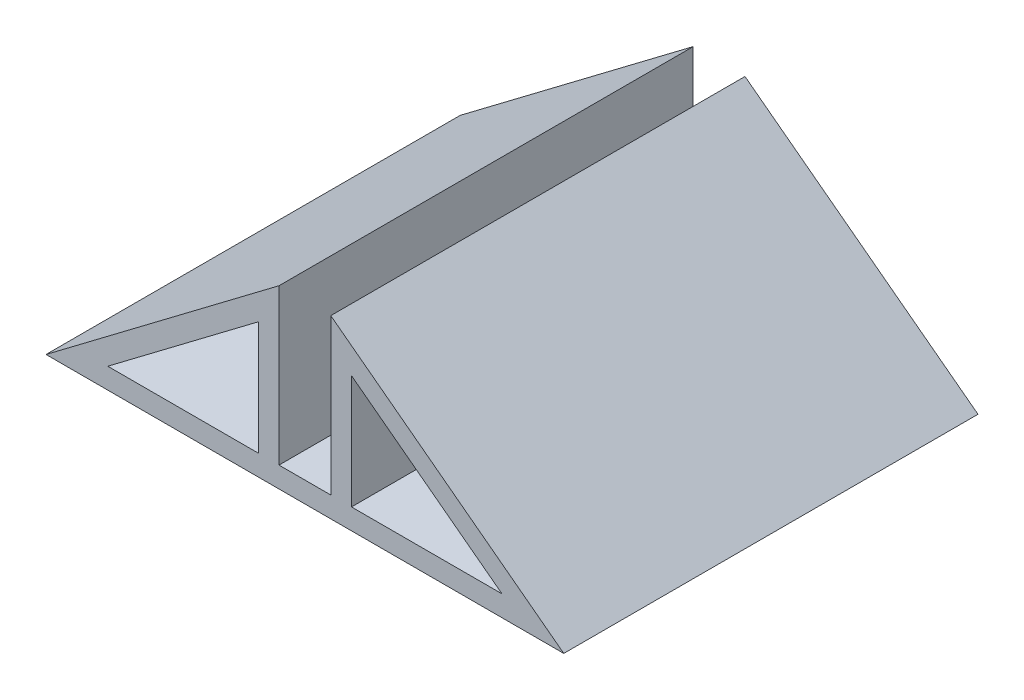
ISO-10303-21;
HEADER;
FILE_DESCRIPTION(('STEP AP214'),'2;1');
FILE_NAME('part.step','',(''),(''),'','','');
FILE_SCHEMA(('AUTOMOTIVE_DESIGN { 1 0 10303 214 1 1 1 1 }'));
ENDSEC;
DATA;
#1=APPLICATION_CONTEXT('core data for automotive mechanical design processes');
#2=APPLICATION_PROTOCOL_DEFINITION('international standard','automotive_design',2000,#1);
#3=PRODUCT_CONTEXT('',#1,'mechanical');
#4=PRODUCT('Part','Part','',(#3));
#5=PRODUCT_RELATED_PRODUCT_CATEGORY('part','',(#4));
#6=PRODUCT_DEFINITION_FORMATION('','',#4);
#7=PRODUCT_DEFINITION_CONTEXT('part definition',#1,'design');
#8=PRODUCT_DEFINITION('design','',#6,#7);
#9=PRODUCT_DEFINITION_SHAPE('','',#8);
#10=(LENGTH_UNIT() NAMED_UNIT(*) SI_UNIT(.MILLI.,.METRE.));
#11=(NAMED_UNIT(*) PLANE_ANGLE_UNIT() SI_UNIT($,.RADIAN.));
#12=(NAMED_UNIT(*) SI_UNIT($,.STERADIAN.) SOLID_ANGLE_UNIT());
#13=UNCERTAINTY_MEASURE_WITH_UNIT(LENGTH_MEASURE(1.E-05),#10,'distance_accuracy_value','');
#14=(GEOMETRIC_REPRESENTATION_CONTEXT(3) GLOBAL_UNCERTAINTY_ASSIGNED_CONTEXT((#13)) GLOBAL_UNIT_ASSIGNED_CONTEXT((#10,
#11,#12)) REPRESENTATION_CONTEXT('',''));
#15=CARTESIAN_POINT('',(0.,0.,0.));
#16=DIRECTION('',(0.,0.,1.));
#17=DIRECTION('',(1.,0.,0.));
#18=AXIS2_PLACEMENT_3D('',#15,#16,#17);
#19=CARTESIAN_POINT('',(-41.503196968335,54.9307018698557,40.));
#20=DIRECTION('',(-0.602833089185688,0.797867323922242,0.));
#21=DIRECTION('',(-0.797867323922242,-0.602833089185688,0.));
#22=AXIS2_PLACEMENT_3D('',#19,#20,#21);
#23=PLANE('',#22);
#24=DIRECTION('',(0.797867323922242,0.602833089185688,0.));
#25=VECTOR('',#24,1.);
#26=CARTESIAN_POINT('',(-41.503196968335,54.9307018698557,0.));
#27=LINE('',#26,#25);
#28=CARTESIAN_POINT('',(-176.322162687231,-46.9325166733095,0.));
#29=VERTEX_POINT('',#28);
#30=CARTESIAN_POINT('',(-161.786889428927,-35.9503102114793,0.));
#31=VERTEX_POINT('',#30);
#32=EDGE_CURVE('E142',#29,#31,#27,.T.);
#33=ORIENTED_EDGE('',*,*,#32,.T.);
#34=DIRECTION('',(0.,0.,-1.));
#35=VECTOR('',#34,1.);
#36=CARTESIAN_POINT('',(-161.786889428927,-35.9503102114793,40.));
#37=LINE('',#36,#35);
#38=CARTESIAN_POINT('',(-161.786889428927,-35.9503102114793,40.));
#39=VERTEX_POINT('',#38);
#40=EDGE_CURVE('E11',#39,#31,#37,.T.);
#41=ORIENTED_EDGE('',*,*,#40,.F.);
#42=DIRECTION('',(0.797867323922242,0.602833089185688,0.));
#43=VECTOR('',#42,1.);
#44=CARTESIAN_POINT('',(-41.503196968335,54.9307018698557,40.));
#45=LINE('',#44,#43);
#46=CARTESIAN_POINT('',(-176.322162687231,-46.9325166733095,40.));
#47=VERTEX_POINT('',#46);
#48=EDGE_CURVE('E134',#47,#39,#45,.T.);
#49=ORIENTED_EDGE('',*,*,#48,.F.);
#50=DIRECTION('',(0.,0.,-1.));
#51=VECTOR('',#50,1.);
#52=CARTESIAN_POINT('',(-176.322162687231,-46.9325166733095,40.));
#53=LINE('',#52,#51);
#54=EDGE_CURVE('E143',#47,#29,#53,.T.);
#55=ORIENTED_EDGE('',*,*,#54,.T.);
#56=EDGE_LOOP('',(#33,#41,#49,#55));
#57=FACE_BOUND('',#56,.T.);
#58=ADVANCED_FACE('F33',(#57),#23,.F.);
#59=CARTESIAN_POINT('',(-161.786889428927,0.,40.));
#60=DIRECTION('',(1.,0.,0.));
#61=DIRECTION('',(0.,0.,-1.));
#62=AXIS2_PLACEMENT_3D('',#59,#60,#61);
#63=PLANE('',#62);
#64=DIRECTION('',(0.,-1.,0.));
#65=VECTOR('',#64,1.);
#66=CARTESIAN_POINT('',(-161.786889428927,0.,0.));
#67=LINE('',#66,#65);
#68=CARTESIAN_POINT('',(-161.786889428927,-46.9325166733095,0.));
#69=VERTEX_POINT('',#68);
#70=EDGE_CURVE('E91',#31,#69,#67,.T.);
#71=ORIENTED_EDGE('',*,*,#70,.T.);
#72=DIRECTION('',(0.,0.,-1.));
#73=VECTOR('',#72,1.);
#74=CARTESIAN_POINT('',(-161.786889428927,-46.9325166733095,40.));
#75=LINE('',#74,#73);
#76=CARTESIAN_POINT('',(-161.786889428927,-46.9325166733095,40.));
#77=VERTEX_POINT('',#76);
#78=EDGE_CURVE('E43',#77,#69,#75,.T.);
#79=ORIENTED_EDGE('',*,*,#78,.F.);
#80=DIRECTION('',(0.,-1.,0.));
#81=VECTOR('',#80,1.);
#82=CARTESIAN_POINT('',(-161.786889428927,0.,40.));
#83=LINE('',#82,#81);
#84=EDGE_CURVE('E130',#39,#77,#83,.T.);
#85=ORIENTED_EDGE('',*,*,#84,.F.);
#86=ORIENTED_EDGE('',*,*,#40,.T.);
#87=EDGE_LOOP('',(#71,#79,#85,#86));
#88=FACE_BOUND('',#87,.T.);
#89=ADVANCED_FACE('F131',(#88),#63,.F.);
#90=CARTESIAN_POINT('',(-71.609680820497,-94.7775187330115,40.));
#91=DIRECTION('',(-0.602833089185689,-0.797867323922242,0.));
#92=DIRECTION('',(0.797867323922242,-0.602833089185689,0.));
#93=AXIS2_PLACEMENT_3D('',#90,#91,#92);
#94=PLANE('',#93);
#95=DIRECTION('',(-0.797867323922242,0.602833089185689,0.));
#96=VECTOR('',#95,1.);
#97=CARTESIAN_POINT('',(-71.609680820497,-94.7775187330115,0.));
#98=LINE('',#97,#96);
#99=CARTESIAN_POINT('',(-132.286889428927,-48.9325166733095,0.));
#100=VERTEX_POINT('',#99);
#101=CARTESIAN_POINT('',(-154.786889428927,-31.9325166733097,0.));
#102=VERTEX_POINT('',#101);
#103=EDGE_CURVE('E193',#100,#102,#98,.T.);
#104=ORIENTED_EDGE('',*,*,#103,.T.);
#105=DIRECTION('',(0.,0.,-1.));
#106=VECTOR('',#105,1.);
#107=CARTESIAN_POINT('',(-154.786889428927,-31.9325166733097,40.));
#108=LINE('',#107,#106);
#109=CARTESIAN_POINT('',(-154.786889428927,-31.9325166733097,40.));
#110=VERTEX_POINT('',#109);
#111=EDGE_CURVE('E156',#110,#102,#108,.T.);
#112=ORIENTED_EDGE('',*,*,#111,.F.);
#113=DIRECTION('',(-0.797867323922242,0.602833089185689,0.));
#114=VECTOR('',#113,1.);
#115=CARTESIAN_POINT('',(-71.609680820497,-94.7775187330115,40.));
#116=LINE('',#115,#114);
#117=CARTESIAN_POINT('',(-132.286889428927,-48.9325166733095,40.));
#118=VERTEX_POINT('',#117);
#119=EDGE_CURVE('E235',#118,#110,#116,.T.);
#120=ORIENTED_EDGE('',*,*,#119,.F.);
#121=DIRECTION('',(0.,0.,-1.));
#122=VECTOR('',#121,1.);
#123=CARTESIAN_POINT('',(-132.286889428927,-48.9325166733095,40.));
#124=LINE('',#123,#122);
#125=EDGE_CURVE('E158',#118,#100,#124,.T.);
#126=ORIENTED_EDGE('',*,*,#125,.T.);
#127=EDGE_LOOP('',(#104,#112,#120,#126));
#128=FACE_BOUND('',#127,.T.);
#129=ADVANCED_FACE('F234',(#128),#94,.F.);
#130=CARTESIAN_POINT('',(-154.786889428927,0.,40.));
#131=DIRECTION('',(1.,0.,0.));
#132=DIRECTION('',(0.,0.,-1.));
#133=AXIS2_PLACEMENT_3D('',#130,#131,#132);
#134=PLANE('',#133);
#135=DIRECTION('',(0.,-1.,0.));
#136=VECTOR('',#135,1.);
#137=CARTESIAN_POINT('',(-154.786889428927,0.,0.));
#138=LINE('',#137,#136);
#139=CARTESIAN_POINT('',(-154.786889428927,-46.9325166733095,0.));
#140=VERTEX_POINT('',#139);
#141=EDGE_CURVE('E199',#102,#140,#138,.T.);
#142=ORIENTED_EDGE('',*,*,#141,.T.);
#143=DIRECTION('',(0.,0.,-1.));
#144=VECTOR('',#143,1.);
#145=CARTESIAN_POINT('',(-154.786889428927,-46.9325166733095,40.));
#146=LINE('',#145,#144);
#147=CARTESIAN_POINT('',(-154.786889428927,-46.9325166733095,40.));
#148=VERTEX_POINT('',#147);
#149=EDGE_CURVE('E166',#148,#140,#146,.T.);
#150=ORIENTED_EDGE('',*,*,#149,.F.);
#151=DIRECTION('',(0.,-1.,0.));
#152=VECTOR('',#151,1.);
#153=CARTESIAN_POINT('',(-154.786889428927,0.,40.));
#154=LINE('',#153,#152);
#155=EDGE_CURVE('E230',#110,#148,#154,.T.);
#156=ORIENTED_EDGE('',*,*,#155,.F.);
#157=ORIENTED_EDGE('',*,*,#111,.T.);
#158=EDGE_LOOP('',(#142,#150,#156,#157));
#159=FACE_BOUND('',#158,.T.);
#160=ADVANCED_FACE('F229',(#159),#134,.F.);
#161=CARTESIAN_POINT('',(0.,-46.9325166733095,40.));
#162=DIRECTION('',(0.,-1.,0.));
#163=DIRECTION('',(0.,0.,-1.));
#164=AXIS2_PLACEMENT_3D('',#161,#162,#163);
#165=PLANE('',#164);
#166=DIRECTION('',(-1.,0.,0.));
#167=VECTOR('',#166,1.);
#168=CARTESIAN_POINT('',(0.,-46.9325166733095,0.));
#169=LINE('',#168,#167);
#170=CARTESIAN_POINT('',(-159.786889428927,-46.9325166733095,0.));
#171=VERTEX_POINT('',#170);
#172=EDGE_CURVE('E201',#140,#171,#169,.T.);
#173=ORIENTED_EDGE('',*,*,#172,.T.);
#174=DIRECTION('',(0.,0.,-1.));
#175=VECTOR('',#174,1.);
#176=CARTESIAN_POINT('',(-159.786889428927,-46.9325166733095,40.));
#177=LINE('',#176,#175);
#178=CARTESIAN_POINT('',(-159.786889428927,-46.9325166733095,40.));
#179=VERTEX_POINT('',#178);
#180=EDGE_CURVE('E164',#179,#171,#177,.T.);
#181=ORIENTED_EDGE('',*,*,#180,.F.);
#182=DIRECTION('',(-1.,0.,0.));
#183=VECTOR('',#182,1.);
#184=CARTESIAN_POINT('',(0.,-46.9325166733095,40.));
#185=LINE('',#184,#183);
#186=EDGE_CURVE('E245',#148,#179,#185,.T.);
#187=ORIENTED_EDGE('',*,*,#186,.F.);
#188=ORIENTED_EDGE('',*,*,#149,.T.);
#189=EDGE_LOOP('',(#173,#181,#187,#188));
#190=FACE_BOUND('',#189,.T.);
#191=ADVANCED_FACE('F225',(#190),#165,.F.);
#192=CARTESIAN_POINT('',(-159.786889428927,0.,40.));
#193=DIRECTION('',(1.,0.,0.));
#194=DIRECTION('',(0.,0.,-1.));
#195=AXIS2_PLACEMENT_3D('',#192,#193,#194);
#196=PLANE('',#195);
#197=DIRECTION('',(0.,-1.,0.));
#198=VECTOR('',#197,1.);
#199=CARTESIAN_POINT('',(-159.786889428927,0.,0.));
#200=LINE('',#199,#198);
#201=CARTESIAN_POINT('',(-159.786889428927,-31.9325166733097,0.));
#202=VERTEX_POINT('',#201);
#203=EDGE_CURVE('E204',#202,#171,#200,.T.);
#204=ORIENTED_EDGE('',*,*,#203,.F.);
#205=DIRECTION('',(0.,0.,-1.));
#206=VECTOR('',#205,1.);
#207=CARTESIAN_POINT('',(-159.786889428927,-31.9325166733097,40.));
#208=LINE('',#207,#206);
#209=CARTESIAN_POINT('',(-159.786889428927,-31.9325166733097,40.));
#210=VERTEX_POINT('',#209);
#211=EDGE_CURVE('E162',#210,#202,#208,.T.);
#212=ORIENTED_EDGE('',*,*,#211,.F.);
#213=DIRECTION('',(0.,-1.,0.));
#214=VECTOR('',#213,1.);
#215=CARTESIAN_POINT('',(-159.786889428927,0.,40.));
#216=LINE('',#215,#214);
#217=EDGE_CURVE('E222',#210,#179,#216,.T.);
#218=ORIENTED_EDGE('',*,*,#217,.T.);
#219=ORIENTED_EDGE('',*,*,#180,.T.);
#220=EDGE_LOOP('',(#204,#212,#218,#219));
#221=FACE_BOUND('',#220,.T.);
#222=ADVANCED_FACE('F220',(#221),#196,.T.);
#223=CARTESIAN_POINT('',(-42.7088631467065,56.5264365177003,40.));
#224=DIRECTION('',(-0.602833089185689,0.797867323922242,0.));
#225=DIRECTION('',(-0.797867323922242,-0.602833089185689,0.));
#226=AXIS2_PLACEMENT_3D('',#223,#224,#225);
#227=PLANE('',#226);
#228=DIRECTION('',(0.797867323922242,0.602833089185689,0.));
#229=VECTOR('',#228,1.);
#230=CARTESIAN_POINT('',(-42.7088631467065,56.5264365177003,0.));
#231=LINE('',#230,#229);
#232=CARTESIAN_POINT('',(-182.286889428927,-48.9325166733095,0.));
#233=VERTEX_POINT('',#232);
#234=EDGE_CURVE('E149',#233,#202,#231,.T.);
#235=ORIENTED_EDGE('',*,*,#234,.F.);
#236=DIRECTION('',(0.,0.,-1.));
#237=VECTOR('',#236,1.);
#238=CARTESIAN_POINT('',(-182.286889428927,-48.9325166733095,40.));
#239=LINE('',#238,#237);
#240=CARTESIAN_POINT('',(-182.286889428927,-48.9325166733095,40.));
#241=VERTEX_POINT('',#240);
#242=EDGE_CURVE('E160',#241,#233,#239,.T.);
#243=ORIENTED_EDGE('',*,*,#242,.F.);
#244=DIRECTION('',(0.797867323922242,0.602833089185689,0.));
#245=VECTOR('',#244,1.);
#246=CARTESIAN_POINT('',(-42.7088631467065,56.5264365177003,40.));
#247=LINE('',#246,#245);
#248=EDGE_CURVE('E216',#241,#210,#247,.T.);
#249=ORIENTED_EDGE('',*,*,#248,.T.);
#250=ORIENTED_EDGE('',*,*,#211,.T.);
#251=EDGE_LOOP('',(#235,#243,#249,#250));
#252=FACE_BOUND('',#251,.T.);
#253=ADVANCED_FACE('F213',(#252),#227,.T.);
#254=CARTESIAN_POINT('',(-72.8153469988683,-96.3732533808561,40.));
#255=DIRECTION('',(-0.602833089185688,-0.797867323922242,0.));
#256=DIRECTION('',(0.797867323922242,-0.602833089185688,0.));
#257=AXIS2_PLACEMENT_3D('',#254,#255,#256);
#258=PLANE('',#257);
#259=DIRECTION('',(-0.797867323922242,0.602833089185688,0.));
#260=VECTOR('',#259,1.);
#261=CARTESIAN_POINT('',(-72.8153469988683,-96.3732533808561,0.));
#262=LINE('',#261,#260);
#263=CARTESIAN_POINT('',(-138.251616170622,-46.9325166733095,0.));
#264=VERTEX_POINT('',#263);
#265=CARTESIAN_POINT('',(-152.786889428927,-35.9503102114793,0.));
#266=VERTEX_POINT('',#265);
#267=EDGE_CURVE('E186',#264,#266,#262,.T.);
#268=ORIENTED_EDGE('',*,*,#267,.F.);
#269=DIRECTION('',(0.,0.,-1.));
#270=VECTOR('',#269,1.);
#271=CARTESIAN_POINT('',(-138.251616170622,-46.9325166733095,40.));
#272=LINE('',#271,#270);
#273=CARTESIAN_POINT('',(-138.251616170622,-46.9325166733095,40.));
#274=VERTEX_POINT('',#273);
#275=EDGE_CURVE('E37',#274,#264,#272,.T.);
#276=ORIENTED_EDGE('',*,*,#275,.F.);
#277=DIRECTION('',(-0.797867323922242,0.602833089185688,0.));
#278=VECTOR('',#277,1.);
#279=CARTESIAN_POINT('',(-72.8153469988683,-96.3732533808561,40.));
#280=LINE('',#279,#278);
#281=CARTESIAN_POINT('',(-152.786889428927,-35.9503102114793,40.));
#282=VERTEX_POINT('',#281);
#283=EDGE_CURVE('E154',#274,#282,#280,.T.);
#284=ORIENTED_EDGE('',*,*,#283,.T.);
#285=DIRECTION('',(0.,0.,-1.));
#286=VECTOR('',#285,1.);
#287=CARTESIAN_POINT('',(-152.786889428927,-35.9503102114793,40.));
#288=LINE('',#287,#286);
#289=EDGE_CURVE('E171',#282,#266,#288,.T.);
#290=ORIENTED_EDGE('',*,*,#289,.T.);
#291=EDGE_LOOP('',(#268,#276,#284,#290));
#292=FACE_BOUND('',#291,.T.);
#293=ADVANCED_FACE('F35',(#292),#258,.T.);
#294=CARTESIAN_POINT('',(0.,-46.9325166733095,40.));
#295=DIRECTION('',(0.,1.,0.));
#296=DIRECTION('',(-1.,0.,0.));
#297=AXIS2_PLACEMENT_3D('',#294,#295,#296);
#298=PLANE('',#297);
#299=DIRECTION('',(1.,0.,0.));
#300=VECTOR('',#299,1.);
#301=CARTESIAN_POINT('',(0.,-46.9325166733095,0.));
#302=LINE('',#301,#300);
#303=CARTESIAN_POINT('',(-152.786889428927,-46.9325166733095,0.));
#304=VERTEX_POINT('',#303);
#305=EDGE_CURVE('E181',#304,#264,#302,.T.);
#306=ORIENTED_EDGE('',*,*,#305,.F.);
#307=DIRECTION('',(0.,0.,-1.));
#308=VECTOR('',#307,1.);
#309=CARTESIAN_POINT('',(-152.786889428927,-46.9325166733095,40.));
#310=LINE('',#309,#308);
#311=CARTESIAN_POINT('',(-152.786889428927,-46.9325166733095,40.));
#312=VERTEX_POINT('',#311);
#313=EDGE_CURVE('E172',#312,#304,#310,.T.);
#314=ORIENTED_EDGE('',*,*,#313,.F.);
#315=DIRECTION('',(1.,0.,0.));
#316=VECTOR('',#315,1.);
#317=CARTESIAN_POINT('',(0.,-46.9325166733095,40.));
#318=LINE('',#317,#316);
#319=EDGE_CURVE('E184',#312,#274,#318,.T.);
#320=ORIENTED_EDGE('',*,*,#319,.T.);
#321=ORIENTED_EDGE('',*,*,#275,.T.);
#322=EDGE_LOOP('',(#306,#314,#320,#321));
#323=FACE_BOUND('',#322,.T.);
#324=ADVANCED_FACE('F179',(#323),#298,.T.);
#325=CARTESIAN_POINT('',(0.,-48.9325166733095,40.));
#326=DIRECTION('',(0.,-1.,0.));
#327=DIRECTION('',(0.,0.,-1.));
#328=AXIS2_PLACEMENT_3D('',#325,#326,#327);
#329=PLANE('',#328);
#330=DIRECTION('',(-1.,0.,0.));
#331=VECTOR('',#330,1.);
#332=CARTESIAN_POINT('',(0.,-48.9325166733095,0.));
#333=LINE('',#332,#331);
#334=EDGE_CURVE('E145',#100,#233,#333,.T.);
#335=ORIENTED_EDGE('',*,*,#334,.F.);
#336=ORIENTED_EDGE('',*,*,#125,.F.);
#337=DIRECTION('',(-1.,0.,0.));
#338=VECTOR('',#337,1.);
#339=CARTESIAN_POINT('',(0.,-48.9325166733095,40.));
#340=LINE('',#339,#338);
#341=EDGE_CURVE('E139',#118,#241,#340,.T.);
#342=ORIENTED_EDGE('',*,*,#341,.T.);
#343=ORIENTED_EDGE('',*,*,#242,.T.);
#344=EDGE_LOOP('',(#335,#336,#342,#343));
#345=FACE_BOUND('',#344,.T.);
#346=ADVANCED_FACE('F239',(#345),#329,.T.);
#347=CARTESIAN_POINT('',(-152.786889428927,0.,40.));
#348=DIRECTION('',(1.,0.,0.));
#349=DIRECTION('',(0.,0.,-1.));
#350=AXIS2_PLACEMENT_3D('',#347,#348,#349);
#351=PLANE('',#350);
#352=DIRECTION('',(0.,-1.,0.));
#353=VECTOR('',#352,1.);
#354=CARTESIAN_POINT('',(-152.786889428927,0.,0.));
#355=LINE('',#354,#353);
#356=EDGE_CURVE('E191',#266,#304,#355,.T.);
#357=ORIENTED_EDGE('',*,*,#356,.F.);
#358=ORIENTED_EDGE('',*,*,#289,.F.);
#359=DIRECTION('',(0.,-1.,0.));
#360=VECTOR('',#359,1.);
#361=CARTESIAN_POINT('',(-152.786889428927,0.,40.));
#362=LINE('',#361,#360);
#363=EDGE_CURVE('E249',#282,#312,#362,.T.);
#364=ORIENTED_EDGE('',*,*,#363,.T.);
#365=ORIENTED_EDGE('',*,*,#313,.T.);
#366=EDGE_LOOP('',(#357,#358,#364,#365));
#367=FACE_BOUND('',#366,.T.);
#368=ADVANCED_FACE('F254',(#367),#351,.T.);
#369=CARTESIAN_POINT('',(0.,-46.9325166733096,40.));
#370=DIRECTION('',(0.,-1.,0.));
#371=DIRECTION('',(1.,0.,0.));
#372=AXIS2_PLACEMENT_3D('',#369,#370,#371);
#373=PLANE('',#372);
#374=DIRECTION('',(-1.,0.,0.));
#375=VECTOR('',#374,1.);
#376=CARTESIAN_POINT('',(0.,-46.9325166733096,0.));
#377=LINE('',#376,#375);
#378=EDGE_CURVE('E97',#69,#29,#377,.T.);
#379=ORIENTED_EDGE('',*,*,#378,.T.);
#380=ORIENTED_EDGE('',*,*,#54,.F.);
#381=DIRECTION('',(-1.,0.,0.));
#382=VECTOR('',#381,1.);
#383=CARTESIAN_POINT('',(0.,-46.9325166733096,40.));
#384=LINE('',#383,#382);
#385=EDGE_CURVE('E52',#77,#47,#384,.T.);
#386=ORIENTED_EDGE('',*,*,#385,.F.);
#387=ORIENTED_EDGE('',*,*,#78,.T.);
#388=EDGE_LOOP('',(#379,#380,#386,#387));
#389=FACE_BOUND('',#388,.T.);
#390=ADVANCED_FACE('F256',(#389),#373,.F.);
#391=CARTESIAN_POINT('',(0.,0.,40.));
#392=DIRECTION('',(0.,0.,1.));
#393=DIRECTION('',(1.,0.,0.));
#394=AXIS2_PLACEMENT_3D('',#391,#392,#393);
#395=PLANE('',#394);
#396=ORIENTED_EDGE('',*,*,#283,.F.);
#397=ORIENTED_EDGE('',*,*,#319,.F.);
#398=ORIENTED_EDGE('',*,*,#363,.F.);
#399=EDGE_LOOP('',(#396,#397,#398));
#400=FACE_BOUND('',#399,.T.);
#401=ORIENTED_EDGE('',*,*,#119,.T.);
#402=ORIENTED_EDGE('',*,*,#155,.T.);
#403=ORIENTED_EDGE('',*,*,#186,.T.);
#404=ORIENTED_EDGE('',*,*,#217,.F.);
#405=ORIENTED_EDGE('',*,*,#248,.F.);
#406=ORIENTED_EDGE('',*,*,#341,.F.);
#407=EDGE_LOOP('',(#401,#402,#403,#404,#405,#406));
#408=FACE_BOUND('',#407,.T.);
#409=ORIENTED_EDGE('',*,*,#48,.T.);
#410=ORIENTED_EDGE('',*,*,#84,.T.);
#411=ORIENTED_EDGE('',*,*,#385,.T.);
#412=EDGE_LOOP('',(#409,#410,#411));
#413=FACE_BOUND('',#412,.T.);
#414=ADVANCED_FACE('F137',(#400,#408,#413),#395,.T.);
#415=CARTESIAN_POINT('',(0.,0.,0.));
#416=DIRECTION('',(0.,0.,1.));
#417=DIRECTION('',(1.,0.,0.));
#418=AXIS2_PLACEMENT_3D('',#415,#416,#417);
#419=PLANE('',#418);
#420=ORIENTED_EDGE('',*,*,#267,.T.);
#421=ORIENTED_EDGE('',*,*,#356,.T.);
#422=ORIENTED_EDGE('',*,*,#305,.T.);
#423=EDGE_LOOP('',(#420,#421,#422));
#424=FACE_BOUND('',#423,.T.);
#425=ORIENTED_EDGE('',*,*,#103,.F.);
#426=ORIENTED_EDGE('',*,*,#334,.T.);
#427=ORIENTED_EDGE('',*,*,#234,.T.);
#428=ORIENTED_EDGE('',*,*,#203,.T.);
#429=ORIENTED_EDGE('',*,*,#172,.F.);
#430=ORIENTED_EDGE('',*,*,#141,.F.);
#431=EDGE_LOOP('',(#425,#426,#427,#428,#429,#430));
#432=FACE_BOUND('',#431,.T.);
#433=ORIENTED_EDGE('',*,*,#32,.F.);
#434=ORIENTED_EDGE('',*,*,#378,.F.);
#435=ORIENTED_EDGE('',*,*,#70,.F.);
#436=EDGE_LOOP('',(#433,#434,#435));
#437=FACE_BOUND('',#436,.T.);
#438=ADVANCED_FACE('F189',(#424,#432,#437),#419,.F.);
#439=CLOSED_SHELL('',(#58,#89,#129,#160,#191,#222,#253,#293,#324,#346,#368,#390,#414,#438));
#440=MANIFOLD_SOLID_BREP('B2',#439);
#441=ADVANCED_BREP_SHAPE_REPRESENTATION('',(#18,#440),#14);
#442=SHAPE_DEFINITION_REPRESENTATION(#9,#441);
ENDSEC;
END-ISO-10303-21;
